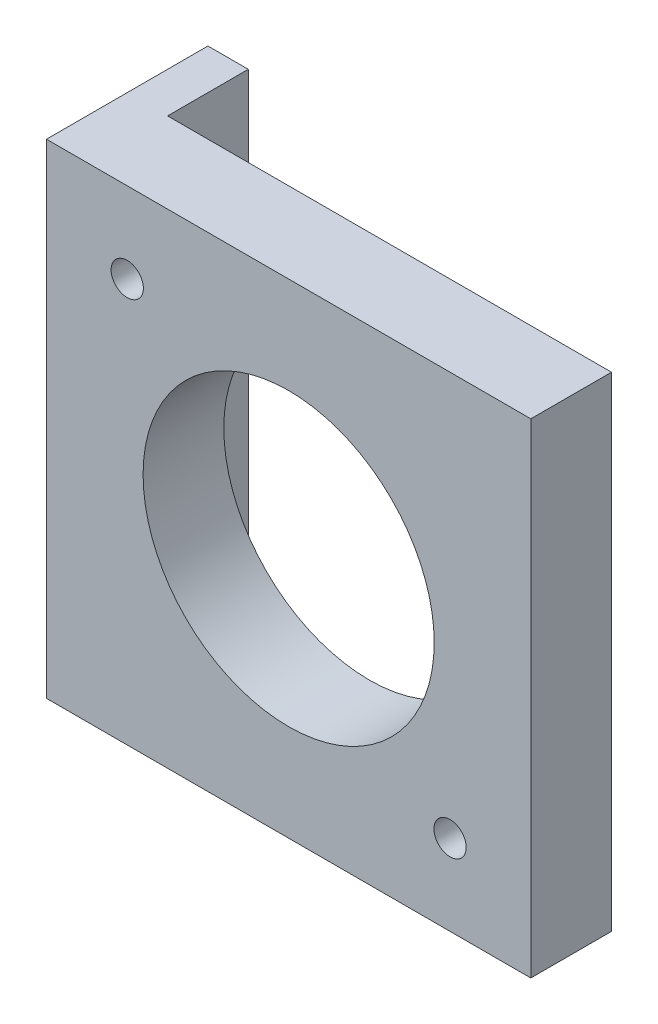
ISO-10303-21;
HEADER;
FILE_DESCRIPTION(('STEP AP214'),'2;1');
FILE_NAME('part.step','',(''),(''),'','','');
FILE_SCHEMA(('AUTOMOTIVE_DESIGN { 1 0 10303 214 1 1 1 1 }'));
ENDSEC;
DATA;
#1=APPLICATION_CONTEXT('core data for automotive mechanical design processes');
#2=APPLICATION_PROTOCOL_DEFINITION('international standard','automotive_design',2000,#1);
#3=PRODUCT_CONTEXT('',#1,'mechanical');
#4=PRODUCT('Part','Part','',(#3));
#5=PRODUCT_RELATED_PRODUCT_CATEGORY('part','',(#4));
#6=PRODUCT_DEFINITION_FORMATION('','',#4);
#7=PRODUCT_DEFINITION_CONTEXT('part definition',#1,'design');
#8=PRODUCT_DEFINITION('design','',#6,#7);
#9=PRODUCT_DEFINITION_SHAPE('','',#8);
#10=(LENGTH_UNIT() NAMED_UNIT(*) SI_UNIT(.MILLI.,.METRE.));
#11=(NAMED_UNIT(*) PLANE_ANGLE_UNIT() SI_UNIT($,.RADIAN.));
#12=(NAMED_UNIT(*) SI_UNIT($,.STERADIAN.) SOLID_ANGLE_UNIT());
#13=UNCERTAINTY_MEASURE_WITH_UNIT(LENGTH_MEASURE(1.E-05),#10,'distance_accuracy_value','');
#14=(GEOMETRIC_REPRESENTATION_CONTEXT(3) GLOBAL_UNCERTAINTY_ASSIGNED_CONTEXT((#13)) GLOBAL_UNIT_ASSIGNED_CONTEXT((#10,
#11,#12)) REPRESENTATION_CONTEXT('',''));
#15=CARTESIAN_POINT('',(0.,0.,0.));
#16=DIRECTION('',(0.,0.,1.));
#17=DIRECTION('',(1.,0.,0.));
#18=AXIS2_PLACEMENT_3D('',#15,#16,#17);
#19=CARTESIAN_POINT('',(0.,60.,0.));
#20=DIRECTION('',(0.,0.,-1.));
#21=DIRECTION('',(-1.,0.,0.));
#22=AXIS2_PLACEMENT_3D('',#19,#20,#21);
#23=PLANE('',#22);
#24=CARTESIAN_POINT('',(50.,10.,0.));
#25=DIRECTION('',(0.,0.,-1.));
#26=DIRECTION('',(-1.,0.,0.));
#27=AXIS2_PLACEMENT_3D('',#24,#25,#26);
#28=CIRCLE('',#27,2.);
#29=CARTESIAN_POINT('',(52.,10.,0.));
#30=VERTEX_POINT('',#29);
#31=EDGE_CURVE('E325',#30,#30,#28,.T.);
#32=ORIENTED_EDGE('',*,*,#31,.F.);
#33=EDGE_LOOP('',(#32));
#34=FACE_BOUND('',#33,.T.);
#35=CARTESIAN_POINT('',(9.99999999999999,50.,0.));
#36=DIRECTION('',(0.,0.,-1.));
#37=DIRECTION('',(-1.,0.,0.));
#38=AXIS2_PLACEMENT_3D('',#35,#36,#37);
#39=CIRCLE('',#38,2.);
#40=CARTESIAN_POINT('',(12.,50.,0.));
#41=VERTEX_POINT('',#40);
#42=EDGE_CURVE('E334',#41,#41,#39,.T.);
#43=ORIENTED_EDGE('',*,*,#42,.F.);
#44=EDGE_LOOP('',(#43));
#45=FACE_BOUND('',#44,.T.);
#46=CARTESIAN_POINT('',(9.99999999999998,10.,0.));
#47=DIRECTION('',(0.,0.,-1.));
#48=DIRECTION('',(-1.,0.,0.));
#49=AXIS2_PLACEMENT_3D('',#46,#47,#48);
#50=CIRCLE('',#49,2.5);
#51=CARTESIAN_POINT('',(7.49999999999998,10.,0.));
#52=VERTEX_POINT('',#51);
#53=EDGE_CURVE('E343',#52,#52,#50,.F.);
#54=ORIENTED_EDGE('',*,*,#53,.T.);
#55=EDGE_LOOP('',(#54));
#56=FACE_BOUND('',#55,.T.);
#57=DIRECTION('',(0.,-1.,0.));
#58=VECTOR('',#57,1.);
#59=CARTESIAN_POINT('',(5.,60.,0.));
#60=LINE('',#59,#58);
#61=CARTESIAN_POINT('',(4.99999999999999,60.,0.));
#62=VERTEX_POINT('',#61);
#63=CARTESIAN_POINT('',(4.99999999999999,0.,0.));
#64=VERTEX_POINT('',#63);
#65=EDGE_CURVE('E51',#62,#64,#60,.T.);
#66=ORIENTED_EDGE('',*,*,#65,.F.);
#67=DIRECTION('',(-1.,0.,0.));
#68=VECTOR('',#67,1.);
#69=CARTESIAN_POINT('',(0.,60.,0.));
#70=LINE('',#69,#68);
#71=CARTESIAN_POINT('',(60.,60.,0.));
#72=VERTEX_POINT('',#71);
#73=EDGE_CURVE('E144',#72,#62,#70,.T.);
#74=ORIENTED_EDGE('',*,*,#73,.F.);
#75=DIRECTION('',(0.,1.,0.));
#76=VECTOR('',#75,1.);
#77=CARTESIAN_POINT('',(60.,0.,0.));
#78=LINE('',#77,#76);
#79=CARTESIAN_POINT('',(60.,0.,0.));
#80=VERTEX_POINT('',#79);
#81=EDGE_CURVE('E76',#80,#72,#78,.T.);
#82=ORIENTED_EDGE('',*,*,#81,.F.);
#83=DIRECTION('',(1.,0.,0.));
#84=VECTOR('',#83,1.);
#85=CARTESIAN_POINT('',(0.,0.,0.));
#86=LINE('',#85,#84);
#87=EDGE_CURVE('E128',#64,#80,#86,.T.);
#88=ORIENTED_EDGE('',*,*,#87,.F.);
#89=EDGE_LOOP('',(#66,#74,#82,#88));
#90=FACE_BOUND('',#89,.T.);
#91=CARTESIAN_POINT('',(30.,30.,0.));
#92=DIRECTION('',(0.,0.,-1.));
#93=DIRECTION('',(-1.,0.,0.));
#94=AXIS2_PLACEMENT_3D('',#91,#92,#93);
#95=CIRCLE('',#94,18.034);
#96=CARTESIAN_POINT('',(11.966,30.,0.));
#97=VERTEX_POINT('',#96);
#98=EDGE_CURVE('E119',#97,#97,#95,.T.);
#99=ORIENTED_EDGE('',*,*,#98,.F.);
#100=EDGE_LOOP('',(#99));
#101=FACE_BOUND('',#100,.T.);
#102=CARTESIAN_POINT('',(50.,50.,0.));
#103=DIRECTION('',(0.,0.,-1.));
#104=DIRECTION('',(-1.,0.,0.));
#105=AXIS2_PLACEMENT_3D('',#102,#103,#104);
#106=CIRCLE('',#105,2.5);
#107=CARTESIAN_POINT('',(50.2685226002793,52.4855372886238,0.));
#108=VERTEX_POINT('',#107);
#109=EDGE_CURVE('E38',#108,#108,#106,.F.);
#110=ORIENTED_EDGE('',*,*,#109,.T.);
#111=EDGE_LOOP('',(#110));
#112=FACE_BOUND('',#111,.T.);
#113=ADVANCED_FACE('F34',(#34,#45,#56,#90,#101,#112),#23,.T.);
#114=CARTESIAN_POINT('',(0.,0.,10.));
#115=DIRECTION('',(1.,0.,0.));
#116=DIRECTION('',(0.,1.,0.));
#117=AXIS2_PLACEMENT_3D('',#114,#115,#116);
#118=PLANE('',#117);
#119=CARTESIAN_POINT('',(0.,10.,-6.));
#120=DIRECTION('',(-1.,0.,0.));
#121=DIRECTION('',(0.,0.,1.));
#122=AXIS2_PLACEMENT_3D('',#119,#120,#121);
#123=CIRCLE('',#122,2.);
#124=CARTESIAN_POINT('',(0.,10.,-4.));
#125=VERTEX_POINT('',#124);
#126=EDGE_CURVE('E344',#125,#125,#123,.T.);
#127=ORIENTED_EDGE('',*,*,#126,.F.);
#128=EDGE_LOOP('',(#127));
#129=FACE_BOUND('',#128,.T.);
#130=CARTESIAN_POINT('',(0.,50.,-6.));
#131=DIRECTION('',(-1.,0.,0.));
#132=DIRECTION('',(0.,0.,1.));
#133=AXIS2_PLACEMENT_3D('',#130,#131,#132);
#134=CIRCLE('',#133,2.);
#135=CARTESIAN_POINT('',(0.,50.,-4.));
#136=VERTEX_POINT('',#135);
#137=EDGE_CURVE('E348',#136,#136,#134,.T.);
#138=ORIENTED_EDGE('',*,*,#137,.F.);
#139=EDGE_LOOP('',(#138));
#140=FACE_BOUND('',#139,.T.);
#141=DIRECTION('',(0.,0.,-1.));
#142=VECTOR('',#141,1.);
#143=CARTESIAN_POINT('',(0.,60.,10.));
#144=LINE('',#143,#142);
#145=CARTESIAN_POINT('',(0.,60.,10.));
#146=VERTEX_POINT('',#145);
#147=CARTESIAN_POINT('',(0.,60.,-10.));
#148=VERTEX_POINT('',#147);
#149=EDGE_CURVE('E148',#146,#148,#144,.T.);
#150=ORIENTED_EDGE('',*,*,#149,.T.);
#151=DIRECTION('',(0.,1.,0.));
#152=VECTOR('',#151,1.);
#153=CARTESIAN_POINT('',(0.,60.,-10.));
#154=LINE('',#153,#152);
#155=CARTESIAN_POINT('',(0.,0.,-10.));
#156=VERTEX_POINT('',#155);
#157=EDGE_CURVE('E107',#156,#148,#154,.T.);
#158=ORIENTED_EDGE('',*,*,#157,.F.);
#159=DIRECTION('',(0.,0.,-1.));
#160=VECTOR('',#159,1.);
#161=CARTESIAN_POINT('',(0.,0.,10.));
#162=LINE('',#161,#160);
#163=CARTESIAN_POINT('',(0.,0.,10.));
#164=VERTEX_POINT('',#163);
#165=EDGE_CURVE('E11',#164,#156,#162,.T.);
#166=ORIENTED_EDGE('',*,*,#165,.F.);
#167=DIRECTION('',(0.,-1.,0.));
#168=VECTOR('',#167,1.);
#169=CARTESIAN_POINT('',(0.,0.,10.));
#170=LINE('',#169,#168);
#171=EDGE_CURVE('E142',#146,#164,#170,.T.);
#172=ORIENTED_EDGE('',*,*,#171,.F.);
#173=EDGE_LOOP('',(#150,#158,#166,#172));
#174=FACE_BOUND('',#173,.T.);
#175=ADVANCED_FACE('F36',(#129,#140,#174),#118,.F.);
#176=CARTESIAN_POINT('',(0.,0.,10.));
#177=DIRECTION('',(0.,1.,0.));
#178=DIRECTION('',(0.,0.,1.));
#179=AXIS2_PLACEMENT_3D('',#176,#177,#178);
#180=PLANE('',#179);
#181=ORIENTED_EDGE('',*,*,#165,.T.);
#182=DIRECTION('',(-1.,0.,0.));
#183=VECTOR('',#182,1.);
#184=CARTESIAN_POINT('',(4.99999999999999,0.,-10.));
#185=LINE('',#184,#183);
#186=CARTESIAN_POINT('',(4.99999999999999,0.,-10.));
#187=VERTEX_POINT('',#186);
#188=EDGE_CURVE('E98',#187,#156,#185,.T.);
#189=ORIENTED_EDGE('',*,*,#188,.F.);
#190=DIRECTION('',(0.,0.,1.));
#191=VECTOR('',#190,1.);
#192=CARTESIAN_POINT('',(4.99999999999999,0.,-10.));
#193=LINE('',#192,#191);
#194=EDGE_CURVE('E102',#187,#64,#193,.T.);
#195=ORIENTED_EDGE('',*,*,#194,.T.);
#196=ORIENTED_EDGE('',*,*,#87,.T.);
#197=DIRECTION('',(0.,0.,-1.));
#198=VECTOR('',#197,1.);
#199=CARTESIAN_POINT('',(60.,0.,10.));
#200=LINE('',#199,#198);
#201=CARTESIAN_POINT('',(60.,0.,10.));
#202=VERTEX_POINT('',#201);
#203=EDGE_CURVE('E43',#202,#80,#200,.T.);
#204=ORIENTED_EDGE('',*,*,#203,.F.);
#205=DIRECTION('',(1.,0.,0.));
#206=VECTOR('',#205,1.);
#207=CARTESIAN_POINT('',(0.,0.,10.));
#208=LINE('',#207,#206);
#209=EDGE_CURVE('E83',#164,#202,#208,.T.);
#210=ORIENTED_EDGE('',*,*,#209,.F.);
#211=EDGE_LOOP('',(#181,#189,#195,#196,#204,#210));
#212=FACE_BOUND('',#211,.T.);
#213=ADVANCED_FACE('F100',(#212),#180,.F.);
#214=CARTESIAN_POINT('',(60.,0.,10.));
#215=DIRECTION('',(-1.,0.,0.));
#216=DIRECTION('',(0.,-1.,0.));
#217=AXIS2_PLACEMENT_3D('',#214,#215,#216);
#218=PLANE('',#217);
#219=ORIENTED_EDGE('',*,*,#81,.T.);
#220=DIRECTION('',(0.,0.,-1.));
#221=VECTOR('',#220,1.);
#222=CARTESIAN_POINT('',(60.,60.,10.));
#223=LINE('',#222,#221);
#224=CARTESIAN_POINT('',(60.,60.,10.));
#225=VERTEX_POINT('',#224);
#226=EDGE_CURVE('E156',#225,#72,#223,.T.);
#227=ORIENTED_EDGE('',*,*,#226,.F.);
#228=DIRECTION('',(0.,1.,0.));
#229=VECTOR('',#228,1.);
#230=CARTESIAN_POINT('',(60.,0.,10.));
#231=LINE('',#230,#229);
#232=EDGE_CURVE('E146',#202,#225,#231,.T.);
#233=ORIENTED_EDGE('',*,*,#232,.F.);
#234=ORIENTED_EDGE('',*,*,#203,.T.);
#235=EDGE_LOOP('',(#219,#227,#233,#234));
#236=FACE_BOUND('',#235,.T.);
#237=ADVANCED_FACE('F163',(#236),#218,.F.);
#238=CARTESIAN_POINT('',(0.,60.,10.));
#239=DIRECTION('',(0.,-1.,0.));
#240=DIRECTION('',(0.,0.,-1.));
#241=AXIS2_PLACEMENT_3D('',#238,#239,#240);
#242=PLANE('',#241);
#243=ORIENTED_EDGE('',*,*,#73,.T.);
#244=DIRECTION('',(0.,0.,1.));
#245=VECTOR('',#244,1.);
#246=CARTESIAN_POINT('',(5.,60.,-10.));
#247=LINE('',#246,#245);
#248=CARTESIAN_POINT('',(5.,60.,-10.));
#249=VERTEX_POINT('',#248);
#250=EDGE_CURVE('E120',#249,#62,#247,.T.);
#251=ORIENTED_EDGE('',*,*,#250,.F.);
#252=DIRECTION('',(1.,0.,0.));
#253=VECTOR('',#252,1.);
#254=CARTESIAN_POINT('',(5.,60.,-10.));
#255=LINE('',#254,#253);
#256=EDGE_CURVE('E113',#148,#249,#255,.T.);
#257=ORIENTED_EDGE('',*,*,#256,.F.);
#258=ORIENTED_EDGE('',*,*,#149,.F.);
#259=DIRECTION('',(-1.,0.,0.));
#260=VECTOR('',#259,1.);
#261=CARTESIAN_POINT('',(0.,60.,10.));
#262=LINE('',#261,#260);
#263=EDGE_CURVE('E60',#225,#146,#262,.T.);
#264=ORIENTED_EDGE('',*,*,#263,.F.);
#265=ORIENTED_EDGE('',*,*,#226,.T.);
#266=EDGE_LOOP('',(#243,#251,#257,#258,#264,#265));
#267=FACE_BOUND('',#266,.T.);
#268=ADVANCED_FACE('F160',(#267),#242,.F.);
#269=CARTESIAN_POINT('',(0.,60.,10.));
#270=DIRECTION('',(0.,0.,-1.));
#271=DIRECTION('',(-1.,0.,0.));
#272=AXIS2_PLACEMENT_3D('',#269,#270,#271);
#273=PLANE('',#272);
#274=CARTESIAN_POINT('',(50.,10.,10.));
#275=DIRECTION('',(0.,0.,1.));
#276=DIRECTION('',(1.,0.,0.));
#277=AXIS2_PLACEMENT_3D('',#274,#275,#276);
#278=CIRCLE('',#277,2.);
#279=CARTESIAN_POINT('',(52.,10.,10.));
#280=VERTEX_POINT('',#279);
#281=EDGE_CURVE('E327',#280,#280,#278,.T.);
#282=ORIENTED_EDGE('',*,*,#281,.F.);
#283=EDGE_LOOP('',(#282));
#284=FACE_BOUND('',#283,.T.);
#285=CARTESIAN_POINT('',(9.99999999999999,50.,10.));
#286=DIRECTION('',(0.,0.,1.));
#287=DIRECTION('',(1.,0.,0.));
#288=AXIS2_PLACEMENT_3D('',#285,#286,#287);
#289=CIRCLE('',#288,2.);
#290=CARTESIAN_POINT('',(12.,50.,10.));
#291=VERTEX_POINT('',#290);
#292=EDGE_CURVE('E329',#291,#291,#289,.T.);
#293=ORIENTED_EDGE('',*,*,#292,.F.);
#294=EDGE_LOOP('',(#293));
#295=FACE_BOUND('',#294,.T.);
#296=CARTESIAN_POINT('',(30.,30.,10.));
#297=DIRECTION('',(0.,0.,-1.));
#298=DIRECTION('',(-1.,0.,0.));
#299=AXIS2_PLACEMENT_3D('',#296,#297,#298);
#300=CIRCLE('',#299,18.034);
#301=CARTESIAN_POINT('',(11.966,30.,10.));
#302=VERTEX_POINT('',#301);
#303=EDGE_CURVE('E123',#302,#302,#300,.T.);
#304=ORIENTED_EDGE('',*,*,#303,.T.);
#305=EDGE_LOOP('',(#304));
#306=FACE_BOUND('',#305,.T.);
#307=ORIENTED_EDGE('',*,*,#171,.T.);
#308=ORIENTED_EDGE('',*,*,#209,.T.);
#309=ORIENTED_EDGE('',*,*,#232,.T.);
#310=ORIENTED_EDGE('',*,*,#263,.T.);
#311=EDGE_LOOP('',(#307,#308,#309,#310));
#312=FACE_BOUND('',#311,.T.);
#313=ADVANCED_FACE('F164',(#284,#295,#306,#312),#273,.F.);
#314=CARTESIAN_POINT('',(30.,30.,10.));
#315=DIRECTION('',(0.,0.,-1.));
#316=DIRECTION('',(-1.,0.,0.));
#317=AXIS2_PLACEMENT_3D('',#314,#315,#316);
#318=CYLINDRICAL_SURFACE('',#317,18.034);
#319=ORIENTED_EDGE('',*,*,#303,.F.);
#320=EDGE_LOOP('',(#319));
#321=FACE_BOUND('',#320,.T.);
#322=ORIENTED_EDGE('',*,*,#98,.T.);
#323=EDGE_LOOP('',(#322));
#324=FACE_BOUND('',#323,.T.);
#325=ADVANCED_FACE('F166',(#321,#324),#318,.F.);
#326=CARTESIAN_POINT('',(5.,60.,-10.));
#327=DIRECTION('',(-1.,0.,0.));
#328=DIRECTION('',(0.,-1.,0.));
#329=AXIS2_PLACEMENT_3D('',#326,#327,#328);
#330=PLANE('',#329);
#331=CARTESIAN_POINT('',(4.99999999999999,10.,-6.));
#332=DIRECTION('',(-1.,0.,0.));
#333=DIRECTION('',(0.,-1.,0.));
#334=AXIS2_PLACEMENT_3D('',#331,#332,#333);
#335=CIRCLE('',#334,2.);
#336=CARTESIAN_POINT('',(4.99999999999999,10.,-4.));
#337=VERTEX_POINT('',#336);
#338=EDGE_CURVE('E347',#337,#337,#335,.T.);
#339=ORIENTED_EDGE('',*,*,#338,.T.);
#340=EDGE_LOOP('',(#339));
#341=FACE_BOUND('',#340,.T.);
#342=CARTESIAN_POINT('',(5.,50.,-6.));
#343=DIRECTION('',(-1.,0.,0.));
#344=DIRECTION('',(0.,-1.,0.));
#345=AXIS2_PLACEMENT_3D('',#342,#343,#344);
#346=CIRCLE('',#345,2.);
#347=CARTESIAN_POINT('',(5.,50.,-4.));
#348=VERTEX_POINT('',#347);
#349=EDGE_CURVE('E134',#348,#348,#346,.T.);
#350=ORIENTED_EDGE('',*,*,#349,.T.);
#351=EDGE_LOOP('',(#350));
#352=FACE_BOUND('',#351,.T.);
#353=ORIENTED_EDGE('',*,*,#65,.T.);
#354=ORIENTED_EDGE('',*,*,#194,.F.);
#355=DIRECTION('',(0.,-1.,0.));
#356=VECTOR('',#355,1.);
#357=CARTESIAN_POINT('',(5.,60.,-10.));
#358=LINE('',#357,#356);
#359=EDGE_CURVE('E108',#249,#187,#358,.T.);
#360=ORIENTED_EDGE('',*,*,#359,.F.);
#361=ORIENTED_EDGE('',*,*,#250,.T.);
#362=EDGE_LOOP('',(#353,#354,#360,#361));
#363=FACE_BOUND('',#362,.T.);
#364=ADVANCED_FACE('F118',(#341,#352,#363),#330,.F.);
#365=CARTESIAN_POINT('',(4.99999999999999,0.,-10.));
#366=DIRECTION('',(0.,0.,-1.));
#367=DIRECTION('',(-1.,0.,0.));
#368=AXIS2_PLACEMENT_3D('',#365,#366,#367);
#369=PLANE('',#368);
#370=ORIENTED_EDGE('',*,*,#359,.T.);
#371=ORIENTED_EDGE('',*,*,#188,.T.);
#372=ORIENTED_EDGE('',*,*,#157,.T.);
#373=ORIENTED_EDGE('',*,*,#256,.T.);
#374=EDGE_LOOP('',(#370,#371,#372,#373));
#375=FACE_BOUND('',#374,.T.);
#376=ADVANCED_FACE('F111',(#375),#369,.T.);
#377=CARTESIAN_POINT('',(60.000025,50.,-6.));
#378=DIRECTION('',(-1.,0.,0.));
#379=DIRECTION('',(0.,0.,1.));
#380=AXIS2_PLACEMENT_3D('',#377,#378,#379);
#381=CYLINDRICAL_SURFACE('',#380,2.);
#382=CARTESIAN_POINT('',(0.,50.,-4.));
#383=CARTESIAN_POINT('',(0.0520833333333322,50.,-4.));
#384=CARTESIAN_POINT('',(0.104166666666664,50.,-4.));
#385=CARTESIAN_POINT('',(0.208333333333331,50.,-4.));
#386=CARTESIAN_POINT('',(0.260416666666666,50.,-4.));
#387=CARTESIAN_POINT('',(0.364583333333335,50.,-4.));
#388=CARTESIAN_POINT('',(0.416666666666669,50.,-4.));
#389=CARTESIAN_POINT('',(0.520833333333336,50.,-4.));
#390=CARTESIAN_POINT('',(0.572916666666668,50.,-4.));
#391=CARTESIAN_POINT('',(0.677083333333333,50.,-4.));
#392=CARTESIAN_POINT('',(0.729166666666665,50.,-4.));
#393=CARTESIAN_POINT('',(0.833333333333332,50.,-4.));
#394=CARTESIAN_POINT('',(0.885416666666666,50.,-4.));
#395=CARTESIAN_POINT('',(0.989583333333335,50.,-4.));
#396=CARTESIAN_POINT('',(1.04166666666667,50.,-4.));
#397=CARTESIAN_POINT('',(1.14583333333334,50.,-4.));
#398=CARTESIAN_POINT('',(1.19791666666667,50.,-4.));
#399=CARTESIAN_POINT('',(1.30208333333333,50.,-4.));
#400=CARTESIAN_POINT('',(1.35416666666667,50.,-4.));
#401=CARTESIAN_POINT('',(1.45833333333333,50.,-4.));
#402=CARTESIAN_POINT('',(1.51041666666667,50.,-4.));
#403=CARTESIAN_POINT('',(1.61458333333334,50.,-4.));
#404=CARTESIAN_POINT('',(1.66666666666667,50.,-4.));
#405=CARTESIAN_POINT('',(1.77083333333334,50.,-4.));
#406=CARTESIAN_POINT('',(1.82291666666667,50.,-4.));
#407=CARTESIAN_POINT('',(1.92708333333333,50.,-4.));
#408=CARTESIAN_POINT('',(1.97916666666667,50.,-4.));
#409=CARTESIAN_POINT('',(2.08333333333333,50.,-4.));
#410=CARTESIAN_POINT('',(2.13541666666667,50.,-4.));
#411=CARTESIAN_POINT('',(2.23958333333334,50.,-4.));
#412=CARTESIAN_POINT('',(2.29166666666667,50.,-4.));
#413=CARTESIAN_POINT('',(2.39583333333334,50.,-4.));
#414=CARTESIAN_POINT('',(2.44791666666667,50.,-4.));
#415=CARTESIAN_POINT('',(2.55208333333333,50.,-4.));
#416=CARTESIAN_POINT('',(2.60416666666667,50.,-4.));
#417=CARTESIAN_POINT('',(2.70833333333333,50.,-4.));
#418=CARTESIAN_POINT('',(2.76041666666667,50.,-4.));
#419=CARTESIAN_POINT('',(2.86458333333334,50.,-4.));
#420=CARTESIAN_POINT('',(2.91666666666667,50.,-4.));
#421=CARTESIAN_POINT('',(3.02083333333334,50.,-4.));
#422=CARTESIAN_POINT('',(3.07291666666667,50.,-4.));
#423=CARTESIAN_POINT('',(3.17708333333334,50.,-4.));
#424=CARTESIAN_POINT('',(3.22916666666667,50.,-4.));
#425=CARTESIAN_POINT('',(3.33333333333333,50.,-4.));
#426=CARTESIAN_POINT('',(3.38541666666667,50.,-4.));
#427=CARTESIAN_POINT('',(3.48958333333334,50.,-4.));
#428=CARTESIAN_POINT('',(3.54166666666667,50.,-4.));
#429=CARTESIAN_POINT('',(3.64583333333334,50.,-4.));
#430=CARTESIAN_POINT('',(3.69791666666667,50.,-4.));
#431=CARTESIAN_POINT('',(3.80208333333334,50.,-4.));
#432=CARTESIAN_POINT('',(3.85416666666667,50.,-4.));
#433=CARTESIAN_POINT('',(3.95833333333333,50.,-4.));
#434=CARTESIAN_POINT('',(4.01041666666667,50.,-4.));
#435=CARTESIAN_POINT('',(4.11458333333334,50.,-4.));
#436=CARTESIAN_POINT('',(4.16666666666667,50.,-4.));
#437=CARTESIAN_POINT('',(4.27083333333334,50.,-4.));
#438=CARTESIAN_POINT('',(4.32291666666667,50.,-4.));
#439=CARTESIAN_POINT('',(4.42708333333334,50.,-4.));
#440=CARTESIAN_POINT('',(4.47916666666667,50.,-4.));
#441=CARTESIAN_POINT('',(4.58333333333333,50.,-4.));
#442=CARTESIAN_POINT('',(4.63541666666667,50.,-4.));
#443=CARTESIAN_POINT('',(4.73958333333334,50.,-4.));
#444=CARTESIAN_POINT('',(4.79166666666667,50.,-4.));
#445=CARTESIAN_POINT('',(4.89583333333334,50.,-4.));
#446=CARTESIAN_POINT('',(4.94791666666667,50.,-4.));
#447=CARTESIAN_POINT('',(5.,50.,-4.));
#448=B_SPLINE_CURVE_WITH_KNOTS('',3,(#382,#383,#384,#385,#386,#387,#388,#389,#390,#391,#392,
#393,#394,#395,#396,#397,#398,#399,#400,#401,#402,#403,#404,#405,#406,#407,#408,#409,#410,#411,
#412,#413,#414,#415,#416,#417,#418,#419,#420,#421,#422,#423,#424,#425,#426,#427,#428,#429,#430,
#431,#432,#433,#434,#435,#436,#437,#438,#439,#440,#441,#442,#443,#444,#445,#446,#447),
.UNSPECIFIED.,.F.,.F.,(4,2,2,2,2,2,2,2,2,2,2,2,2,2,2,2,2,2,2,2,2,2,2,2,2,2,2,2,2,2,2,2,4),(0.,
0.156249999999997,0.3125,0.468750000000004,0.625000000000001,0.781249999999997,
0.937500000000001,1.09375,1.25,1.40625,1.5625,1.71875,1.875,2.03125,2.1875,2.34375000000001,2.5,
2.65625,2.8125,2.96875000000001,3.125,3.28125,3.4375,3.59375000000001,3.75,3.90625,4.0625,
4.21875000000001,4.375,4.53125,4.6875,4.84375000000001,5.),.UNSPECIFIED.);
#449=EDGE_CURVE('BSEAM214',#136,#348,#448,.T.);
#450=ORIENTED_EDGE('',*,*,#137,.T.);
#451=ORIENTED_EDGE('',*,*,#349,.F.);
#452=ORIENTED_EDGE('',*,*,#449,.T.);
#453=ORIENTED_EDGE('',*,*,#449,.F.);
#454=EDGE_LOOP('',(#450,#452,#451,#453));
#455=FACE_BOUND('',#454,.T.);
#456=ADVANCED_FACE('F214',(#455),#381,.F.);
#457=CARTESIAN_POINT('',(60.000025,10.,-6.));
#458=DIRECTION('',(-1.,0.,0.));
#459=DIRECTION('',(0.,0.,1.));
#460=AXIS2_PLACEMENT_3D('',#457,#458,#459);
#461=CYLINDRICAL_SURFACE('',#460,2.);
#462=CARTESIAN_POINT('',(0.,10.,-4.));
#463=CARTESIAN_POINT('',(0.0520833333333322,10.,-4.));
#464=CARTESIAN_POINT('',(0.104166666666664,10.,-4.));
#465=CARTESIAN_POINT('',(0.208333333333331,10.,-4.));
#466=CARTESIAN_POINT('',(0.260416666666666,10.,-4.));
#467=CARTESIAN_POINT('',(0.364583333333332,10.,-4.));
#468=CARTESIAN_POINT('',(0.416666666666665,10.,-4.));
#469=CARTESIAN_POINT('',(0.520833333333331,10.,-4.));
#470=CARTESIAN_POINT('',(0.572916666666666,10.,-4.));
#471=CARTESIAN_POINT('',(0.677083333333333,10.,-4.));
#472=CARTESIAN_POINT('',(0.729166666666665,10.,-4.));
#473=CARTESIAN_POINT('',(0.833333333333332,10.,-4.));
#474=CARTESIAN_POINT('',(0.885416666666666,10.,-4.));
#475=CARTESIAN_POINT('',(0.989583333333333,10.,-4.));
#476=CARTESIAN_POINT('',(1.04166666666667,10.,-4.));
#477=CARTESIAN_POINT('',(1.14583333333333,10.,-4.));
#478=CARTESIAN_POINT('',(1.19791666666667,10.,-4.));
#479=CARTESIAN_POINT('',(1.30208333333333,10.,-4.));
#480=CARTESIAN_POINT('',(1.35416666666667,10.,-4.));
#481=CARTESIAN_POINT('',(1.45833333333333,10.,-4.));
#482=CARTESIAN_POINT('',(1.51041666666666,10.,-4.));
#483=CARTESIAN_POINT('',(1.61458333333333,10.,-4.));
#484=CARTESIAN_POINT('',(1.66666666666666,10.,-4.));
#485=CARTESIAN_POINT('',(1.77083333333333,10.,-4.));
#486=CARTESIAN_POINT('',(1.82291666666666,10.,-4.));
#487=CARTESIAN_POINT('',(1.92708333333333,10.,-4.));
#488=CARTESIAN_POINT('',(1.97916666666666,10.,-4.));
#489=CARTESIAN_POINT('',(2.08333333333333,10.,-4.));
#490=CARTESIAN_POINT('',(2.13541666666666,10.,-4.));
#491=CARTESIAN_POINT('',(2.23958333333333,10.,-4.));
#492=CARTESIAN_POINT('',(2.29166666666666,10.,-4.));
#493=CARTESIAN_POINT('',(2.39583333333333,10.,-4.));
#494=CARTESIAN_POINT('',(2.44791666666666,10.,-4.));
#495=CARTESIAN_POINT('',(2.55208333333333,10.,-4.));
#496=CARTESIAN_POINT('',(2.60416666666666,10.,-4.));
#497=CARTESIAN_POINT('',(2.70833333333333,10.,-4.));
#498=CARTESIAN_POINT('',(2.76041666666666,10.,-4.));
#499=CARTESIAN_POINT('',(2.86458333333333,10.,-4.));
#500=CARTESIAN_POINT('',(2.91666666666666,10.,-4.));
#501=CARTESIAN_POINT('',(3.02083333333333,10.,-4.));
#502=CARTESIAN_POINT('',(3.07291666666666,10.,-4.));
#503=CARTESIAN_POINT('',(3.17708333333333,10.,-4.));
#504=CARTESIAN_POINT('',(3.22916666666666,10.,-4.));
#505=CARTESIAN_POINT('',(3.33333333333333,10.,-4.));
#506=CARTESIAN_POINT('',(3.38541666666666,10.,-4.));
#507=CARTESIAN_POINT('',(3.48958333333333,10.,-4.));
#508=CARTESIAN_POINT('',(3.54166666666666,10.,-4.));
#509=CARTESIAN_POINT('',(3.64583333333333,10.,-4.));
#510=CARTESIAN_POINT('',(3.69791666666666,10.,-4.));
#511=CARTESIAN_POINT('',(3.80208333333332,10.,-4.));
#512=CARTESIAN_POINT('',(3.85416666666666,10.,-4.));
#513=CARTESIAN_POINT('',(3.95833333333333,10.,-4.));
#514=CARTESIAN_POINT('',(4.01041666666666,10.,-4.));
#515=CARTESIAN_POINT('',(4.11458333333332,10.,-4.));
#516=CARTESIAN_POINT('',(4.16666666666666,10.,-4.));
#517=CARTESIAN_POINT('',(4.27083333333333,10.,-4.));
#518=CARTESIAN_POINT('',(4.32291666666666,10.,-4.));
#519=CARTESIAN_POINT('',(4.42708333333332,10.,-4.));
#520=CARTESIAN_POINT('',(4.47916666666666,10.,-4.));
#521=CARTESIAN_POINT('',(4.58333333333333,10.,-4.));
#522=CARTESIAN_POINT('',(4.63541666666666,10.,-4.));
#523=CARTESIAN_POINT('',(4.73958333333333,10.,-4.));
#524=CARTESIAN_POINT('',(4.79166666666666,10.,-4.));
#525=CARTESIAN_POINT('',(4.89583333333333,10.,-4.));
#526=CARTESIAN_POINT('',(4.94791666666666,10.,-4.));
#527=CARTESIAN_POINT('',(4.99999999999999,10.,-4.));
#528=B_SPLINE_CURVE_WITH_KNOTS('',3,(#462,#463,#464,#465,#466,#467,#468,#469,#470,#471,#472,
#473,#474,#475,#476,#477,#478,#479,#480,#481,#482,#483,#484,#485,#486,#487,#488,#489,#490,#491,
#492,#493,#494,#495,#496,#497,#498,#499,#500,#501,#502,#503,#504,#505,#506,#507,#508,#509,#510,
#511,#512,#513,#514,#515,#516,#517,#518,#519,#520,#521,#522,#523,#524,#525,#526,#527),
.UNSPECIFIED.,.F.,.F.,(4,2,2,2,2,2,2,2,2,2,2,2,2,2,2,2,2,2,2,2,2,2,2,2,2,2,2,2,2,2,2,2,4),(0.,
0.156249999999997,0.3125,0.468749999999997,0.625000000000001,0.781249999999997,
0.937500000000001,1.09375,1.25,1.40625,1.56249999999999,1.71875,1.87499999999999,2.03125,2.1875,
2.34375,2.5,2.65624999999999,2.8125,2.96874999999999,3.125,3.28124999999999,3.4375,
3.59374999999999,3.74999999999999,3.90624999999999,4.06249999999999,4.21874999999999,
4.37499999999999,4.53124999999999,4.68749999999999,4.84374999999999,4.99999999999999),.UNSPECIFIED.);
#529=EDGE_CURVE('BSEAM239',#125,#337,#528,.T.);
#530=ORIENTED_EDGE('',*,*,#126,.T.);
#531=ORIENTED_EDGE('',*,*,#338,.F.);
#532=ORIENTED_EDGE('',*,*,#529,.T.);
#533=ORIENTED_EDGE('',*,*,#529,.F.);
#534=EDGE_LOOP('',(#530,#532,#531,#533));
#535=FACE_BOUND('',#534,.T.);
#536=ADVANCED_FACE('F239',(#535),#461,.F.);
#537=CARTESIAN_POINT('',(9.99999999999998,10.,4.99999999999999));
#538=DIRECTION('',(0.,0.,-1.));
#539=DIRECTION('',(-0.99716147316356,-0.0752927382838369,0.));
#540=AXIS2_PLACEMENT_3D('',#537,#538,#539);
#541=CYLINDRICAL_SURFACE('',#540,2.5);
#542=ORIENTED_EDGE('',*,*,#53,.F.);
#543=EDGE_LOOP('',(#542));
#544=FACE_BOUND('',#543,.T.);
#545=CARTESIAN_POINT('',(9.99999999999998,10.,4.99999999999999));
#546=DIRECTION('',(0.,0.,1.));
#547=DIRECTION('',(0.99716147316356,0.0752927382838369,0.));
#548=AXIS2_PLACEMENT_3D('',#545,#546,#547);
#549=CIRCLE('',#548,2.5);
#550=CARTESIAN_POINT('',(12.4929036829089,10.1882318457096,4.99999999999999));
#551=VERTEX_POINT('',#550);
#552=EDGE_CURVE('E340',#551,#551,#549,.T.);
#553=ORIENTED_EDGE('',*,*,#552,.T.);
#554=EDGE_LOOP('',(#553));
#555=FACE_BOUND('',#554,.T.);
#556=ADVANCED_FACE('F249',(#544,#555),#541,.F.);
#557=CARTESIAN_POINT('',(9.99999999999998,10.,4.99999999999999));
#558=DIRECTION('',(0.,0.,1.));
#559=DIRECTION('',(0.99716147316356,0.0752927382838369,0.));
#560=AXIS2_PLACEMENT_3D('',#557,#558,#559);
#561=PLANE('',#560);
#562=ORIENTED_EDGE('',*,*,#552,.F.);
#563=EDGE_LOOP('',(#562));
#564=FACE_BOUND('',#563,.T.);
#565=ADVANCED_FACE('F260',(#564),#561,.F.);
#566=CARTESIAN_POINT('',(50.,50.,4.99999999999999));
#567=DIRECTION('',(0.,0.,-1.));
#568=DIRECTION('',(0.107409040111746,0.994214915449508,0.));
#569=AXIS2_PLACEMENT_3D('',#566,#567,#568);
#570=CYLINDRICAL_SURFACE('',#569,2.5);
#571=CARTESIAN_POINT('',(50.,50.,4.99999999999999));
#572=DIRECTION('',(0.,0.,1.));
#573=DIRECTION('',(-0.107409040111746,-0.994214915449508,0.));
#574=AXIS2_PLACEMENT_3D('',#571,#572,#573);
#575=CIRCLE('',#574,2.5);
#576=CARTESIAN_POINT('',(50.2685226002793,52.4855372886238,4.99999999999999));
#577=VERTEX_POINT('',#576);
#578=EDGE_CURVE('E337',#577,#577,#575,.T.);
#579=CARTESIAN_POINT('',(50.2685226002793,52.4855372886238,0.));
#580=CARTESIAN_POINT('',(50.2685226002793,52.4855372886238,0.0520833333333341));
#581=CARTESIAN_POINT('',(50.2685226002793,52.4855372886238,0.104166666666668));
#582=CARTESIAN_POINT('',(50.2685226002793,52.4855372886238,0.208333333333334));
#583=CARTESIAN_POINT('',(50.2685226002793,52.4855372886238,0.260416666666667));
#584=CARTESIAN_POINT('',(50.2685226002793,52.4855372886238,0.364583333333333));
#585=CARTESIAN_POINT('',(50.2685226002793,52.4855372886238,0.416666666666666));
#586=CARTESIAN_POINT('',(50.2685226002793,52.4855372886238,0.520833333333333));
#587=CARTESIAN_POINT('',(50.2685226002793,52.4855372886238,0.572916666666666));
#588=CARTESIAN_POINT('',(50.2685226002793,52.4855372886238,0.677083333333333));
#589=CARTESIAN_POINT('',(50.2685226002793,52.4855372886238,0.729166666666667));
#590=CARTESIAN_POINT('',(50.2685226002793,52.4855372886238,0.833333333333333));
#591=CARTESIAN_POINT('',(50.2685226002793,52.4855372886238,0.885416666666666));
#592=CARTESIAN_POINT('',(50.2685226002793,52.4855372886238,0.989583333333332));
#593=CARTESIAN_POINT('',(50.2685226002793,52.4855372886238,1.04166666666667));
#594=CARTESIAN_POINT('',(50.2685226002793,52.4855372886238,1.14583333333333));
#595=CARTESIAN_POINT('',(50.2685226002793,52.4855372886238,1.19791666666666));
#596=CARTESIAN_POINT('',(50.2685226002793,52.4855372886238,1.30208333333333));
#597=CARTESIAN_POINT('',(50.2685226002793,52.4855372886238,1.35416666666666));
#598=CARTESIAN_POINT('',(50.2685226002793,52.4855372886238,1.45833333333333));
#599=CARTESIAN_POINT('',(50.2685226002793,52.4855372886238,1.51041666666666));
#600=CARTESIAN_POINT('',(50.2685226002793,52.4855372886238,1.61458333333333));
#601=CARTESIAN_POINT('',(50.2685226002793,52.4855372886238,1.66666666666666));
#602=CARTESIAN_POINT('',(50.2685226002793,52.4855372886238,1.77083333333333));
#603=CARTESIAN_POINT('',(50.2685226002793,52.4855372886238,1.82291666666666));
#604=CARTESIAN_POINT('',(50.2685226002793,52.4855372886238,1.92708333333333));
#605=CARTESIAN_POINT('',(50.2685226002793,52.4855372886238,1.97916666666666));
#606=CARTESIAN_POINT('',(50.2685226002793,52.4855372886238,2.08333333333333));
#607=CARTESIAN_POINT('',(50.2685226002793,52.4855372886238,2.13541666666666));
#608=CARTESIAN_POINT('',(50.2685226002793,52.4855372886238,2.23958333333333));
#609=CARTESIAN_POINT('',(50.2685226002793,52.4855372886238,2.29166666666666));
#610=CARTESIAN_POINT('',(50.2685226002793,52.4855372886238,2.39583333333333));
#611=CARTESIAN_POINT('',(50.2685226002793,52.4855372886238,2.44791666666666));
#612=CARTESIAN_POINT('',(50.2685226002793,52.4855372886238,2.55208333333333));
#613=CARTESIAN_POINT('',(50.2685226002793,52.4855372886238,2.60416666666666));
#614=CARTESIAN_POINT('',(50.2685226002793,52.4855372886238,2.70833333333333));
#615=CARTESIAN_POINT('',(50.2685226002793,52.4855372886238,2.76041666666666));
#616=CARTESIAN_POINT('',(50.2685226002793,52.4855372886238,2.86458333333333));
#617=CARTESIAN_POINT('',(50.2685226002793,52.4855372886238,2.91666666666666));
#618=CARTESIAN_POINT('',(50.2685226002793,52.4855372886238,3.02083333333333));
#619=CARTESIAN_POINT('',(50.2685226002793,52.4855372886238,3.07291666666666));
#620=CARTESIAN_POINT('',(50.2685226002793,52.4855372886238,3.17708333333333));
#621=CARTESIAN_POINT('',(50.2685226002793,52.4855372886238,3.22916666666666));
#622=CARTESIAN_POINT('',(50.2685226002793,52.4855372886238,3.33333333333333));
#623=CARTESIAN_POINT('',(50.2685226002793,52.4855372886238,3.38541666666666));
#624=CARTESIAN_POINT('',(50.2685226002793,52.4855372886238,3.48958333333333));
#625=CARTESIAN_POINT('',(50.2685226002793,52.4855372886238,3.54166666666666));
#626=CARTESIAN_POINT('',(50.2685226002793,52.4855372886238,3.64583333333333));
#627=CARTESIAN_POINT('',(50.2685226002793,52.4855372886238,3.69791666666666));
#628=CARTESIAN_POINT('',(50.2685226002793,52.4855372886238,3.80208333333333));
#629=CARTESIAN_POINT('',(50.2685226002793,52.4855372886238,3.85416666666666));
#630=CARTESIAN_POINT('',(50.2685226002793,52.4855372886238,3.95833333333333));
#631=CARTESIAN_POINT('',(50.2685226002793,52.4855372886238,4.01041666666666));
#632=CARTESIAN_POINT('',(50.2685226002793,52.4855372886238,4.11458333333333));
#633=CARTESIAN_POINT('',(50.2685226002793,52.4855372886238,4.16666666666666));
#634=CARTESIAN_POINT('',(50.2685226002793,52.4855372886238,4.27083333333333));
#635=CARTESIAN_POINT('',(50.2685226002793,52.4855372886238,4.32291666666666));
#636=CARTESIAN_POINT('',(50.2685226002793,52.4855372886238,4.42708333333333));
#637=CARTESIAN_POINT('',(50.2685226002793,52.4855372886238,4.47916666666666));
#638=CARTESIAN_POINT('',(50.2685226002793,52.4855372886238,4.58333333333333));
#639=CARTESIAN_POINT('',(50.2685226002793,52.4855372886238,4.63541666666666));
#640=CARTESIAN_POINT('',(50.2685226002793,52.4855372886238,4.73958333333332));
#641=CARTESIAN_POINT('',(50.2685226002793,52.4855372886238,4.79166666666666));
#642=CARTESIAN_POINT('',(50.2685226002793,52.4855372886238,4.89583333333332));
#643=CARTESIAN_POINT('',(50.2685226002793,52.4855372886238,4.94791666666666));
#644=CARTESIAN_POINT('',(50.2685226002793,52.4855372886238,4.99999999999999));
#645=B_SPLINE_CURVE_WITH_KNOTS('',3,(#579,#580,#581,#582,#583,#584,#585,#586,#587,#588,#589,
#590,#591,#592,#593,#594,#595,#596,#597,#598,#599,#600,#601,#602,#603,#604,#605,#606,#607,#608,
#609,#610,#611,#612,#613,#614,#615,#616,#617,#618,#619,#620,#621,#622,#623,#624,#625,#626,#627,
#628,#629,#630,#631,#632,#633,#634,#635,#636,#637,#638,#639,#640,#641,#642,#643,#644),
.UNSPECIFIED.,.F.,.F.,(4,2,2,2,2,2,2,2,2,2,2,2,2,2,2,2,2,2,2,2,2,2,2,2,2,2,2,2,2,2,2,2,4),(0.,
0.15625,0.312499999999999,0.468749999999999,0.624999999999999,0.781249999999999,
0.937499999999998,1.09375,1.25,1.40625,1.5625,1.71875,1.875,2.03125,2.1875,2.34375,
2.49999999999999,2.65624999999999,2.81249999999999,2.96874999999999,3.12499999999999,
3.28124999999999,3.43749999999999,3.59374999999999,3.74999999999999,3.90624999999999,
4.06249999999999,4.21874999999999,4.37499999999999,4.53124999999999,4.68749999999999,
4.84374999999999,4.99999999999999),.UNSPECIFIED.);
#646=EDGE_CURVE('BSEAM270',#108,#577,#645,.T.);
#647=ORIENTED_EDGE('',*,*,#109,.F.);
#648=ORIENTED_EDGE('',*,*,#578,.T.);
#649=ORIENTED_EDGE('',*,*,#646,.T.);
#650=ORIENTED_EDGE('',*,*,#646,.F.);
#651=EDGE_LOOP('',(#647,#649,#648,#650));
#652=FACE_BOUND('',#651,.T.);
#653=ADVANCED_FACE('F270',(#652),#570,.F.);
#654=CARTESIAN_POINT('',(50.,50.,4.99999999999999));
#655=DIRECTION('',(0.,0.,1.));
#656=DIRECTION('',(-0.107409040111746,-0.994214915449508,0.));
#657=AXIS2_PLACEMENT_3D('',#654,#655,#656);
#658=PLANE('',#657);
#659=ORIENTED_EDGE('',*,*,#578,.F.);
#660=EDGE_LOOP('',(#659));
#661=FACE_BOUND('',#660,.T.);
#662=ADVANCED_FACE('F280',(#661),#658,.F.);
#663=CARTESIAN_POINT('',(9.99999999999999,50.,-10.000025));
#664=DIRECTION('',(0.,0.,1.));
#665=DIRECTION('',(1.,0.,0.));
#666=AXIS2_PLACEMENT_3D('',#663,#664,#665);
#667=CYLINDRICAL_SURFACE('',#666,2.);
#668=CARTESIAN_POINT('',(12.,50.,0.));
#669=CARTESIAN_POINT('',(12.,50.,0.104166666666667));
#670=CARTESIAN_POINT('',(12.,50.,0.208333333333334));
#671=CARTESIAN_POINT('',(12.,50.,0.416666666666667));
#672=CARTESIAN_POINT('',(12.,50.,0.520833333333334));
#673=CARTESIAN_POINT('',(12.,50.,0.729166666666667));
#674=CARTESIAN_POINT('',(12.,50.,0.833333333333334));
#675=CARTESIAN_POINT('',(12.,50.,1.04166666666667));
#676=CARTESIAN_POINT('',(12.,50.,1.14583333333333));
#677=CARTESIAN_POINT('',(12.,50.,1.35416666666667));
#678=CARTESIAN_POINT('',(12.,50.,1.45833333333333));
#679=CARTESIAN_POINT('',(12.,50.,1.66666666666667));
#680=CARTESIAN_POINT('',(12.,50.,1.77083333333333));
#681=CARTESIAN_POINT('',(12.,50.,1.97916666666667));
#682=CARTESIAN_POINT('',(12.,50.,2.08333333333333));
#683=CARTESIAN_POINT('',(12.,50.,2.29166666666667));
#684=CARTESIAN_POINT('',(12.,50.,2.39583333333333));
#685=CARTESIAN_POINT('',(12.,50.,2.60416666666667));
#686=CARTESIAN_POINT('',(12.,50.,2.70833333333333));
#687=CARTESIAN_POINT('',(12.,50.,2.91666666666667));
#688=CARTESIAN_POINT('',(12.,50.,3.02083333333333));
#689=CARTESIAN_POINT('',(12.,50.,3.22916666666667));
#690=CARTESIAN_POINT('',(12.,50.,3.33333333333333));
#691=CARTESIAN_POINT('',(12.,50.,3.54166666666667));
#692=CARTESIAN_POINT('',(12.,50.,3.64583333333333));
#693=CARTESIAN_POINT('',(12.,50.,3.85416666666667));
#694=CARTESIAN_POINT('',(12.,50.,3.95833333333333));
#695=CARTESIAN_POINT('',(12.,50.,4.16666666666667));
#696=CARTESIAN_POINT('',(12.,50.,4.27083333333333));
#697=CARTESIAN_POINT('',(12.,50.,4.47916666666667));
#698=CARTESIAN_POINT('',(12.,50.,4.58333333333333));
#699=CARTESIAN_POINT('',(12.,50.,4.79166666666667));
#700=CARTESIAN_POINT('',(12.,50.,4.89583333333333));
#701=CARTESIAN_POINT('',(12.,50.,5.10416666666667));
#702=CARTESIAN_POINT('',(12.,50.,5.20833333333333));
#703=CARTESIAN_POINT('',(12.,50.,5.41666666666667));
#704=CARTESIAN_POINT('',(12.,50.,5.52083333333333));
#705=CARTESIAN_POINT('',(12.,50.,5.72916666666667));
#706=CARTESIAN_POINT('',(12.,50.,5.83333333333333));
#707=CARTESIAN_POINT('',(12.,50.,6.04166666666667));
#708=CARTESIAN_POINT('',(12.,50.,6.14583333333333));
#709=CARTESIAN_POINT('',(12.,50.,6.35416666666667));
#710=CARTESIAN_POINT('',(12.,50.,6.45833333333333));
#711=CARTESIAN_POINT('',(12.,50.,6.66666666666667));
#712=CARTESIAN_POINT('',(12.,50.,6.77083333333333));
#713=CARTESIAN_POINT('',(12.,50.,6.97916666666666));
#714=CARTESIAN_POINT('',(12.,50.,7.08333333333333));
#715=CARTESIAN_POINT('',(12.,50.,7.29166666666666));
#716=CARTESIAN_POINT('',(12.,50.,7.39583333333333));
#717=CARTESIAN_POINT('',(12.,50.,7.60416666666666));
#718=CARTESIAN_POINT('',(12.,50.,7.70833333333333));
#719=CARTESIAN_POINT('',(12.,50.,7.91666666666667));
#720=CARTESIAN_POINT('',(12.,50.,8.02083333333333));
#721=CARTESIAN_POINT('',(12.,50.,8.22916666666667));
#722=CARTESIAN_POINT('',(12.,50.,8.33333333333333));
#723=CARTESIAN_POINT('',(12.,50.,8.54166666666667));
#724=CARTESIAN_POINT('',(12.,50.,8.64583333333333));
#725=CARTESIAN_POINT('',(12.,50.,8.85416666666667));
#726=CARTESIAN_POINT('',(12.,50.,8.95833333333333));
#727=CARTESIAN_POINT('',(12.,50.,9.16666666666667));
#728=CARTESIAN_POINT('',(12.,50.,9.27083333333333));
#729=CARTESIAN_POINT('',(12.,50.,9.47916666666667));
#730=CARTESIAN_POINT('',(12.,50.,9.58333333333333));
#731=CARTESIAN_POINT('',(12.,50.,9.79166666666667));
#732=CARTESIAN_POINT('',(12.,50.,9.89583333333333));
#733=CARTESIAN_POINT('',(12.,50.,10.));
#734=B_SPLINE_CURVE_WITH_KNOTS('',3,(#668,#669,#670,#671,#672,#673,#674,#675,#676,#677,#678,
#679,#680,#681,#682,#683,#684,#685,#686,#687,#688,#689,#690,#691,#692,#693,#694,#695,#696,#697,
#698,#699,#700,#701,#702,#703,#704,#705,#706,#707,#708,#709,#710,#711,#712,#713,#714,#715,#716,
#717,#718,#719,#720,#721,#722,#723,#724,#725,#726,#727,#728,#729,#730,#731,#732,#733),
.UNSPECIFIED.,.F.,.F.,(4,2,2,2,2,2,2,2,2,2,2,2,2,2,2,2,2,2,2,2,2,2,2,2,2,2,2,2,2,2,2,2,4),(0.,
0.3125,0.625000000000001,0.937500000000001,1.25,1.5625,1.875,2.1875,2.5,2.8125,3.125,3.4375,
3.75,4.0625,4.375,4.6875,5.,5.3125,5.625,5.9375,6.25,6.5625,6.875,7.1875,7.5,7.8125,8.125,
8.4375,8.75,9.0625,9.375,9.6875,10.),.UNSPECIFIED.);
#735=EDGE_CURVE('BSEAM290',#41,#291,#734,.T.);
#736=ORIENTED_EDGE('',*,*,#42,.T.);
#737=ORIENTED_EDGE('',*,*,#292,.T.);
#738=ORIENTED_EDGE('',*,*,#735,.T.);
#739=ORIENTED_EDGE('',*,*,#735,.F.);
#740=EDGE_LOOP('',(#736,#738,#737,#739));
#741=FACE_BOUND('',#740,.T.);
#742=ADVANCED_FACE('F290',(#741),#667,.F.);
#743=CARTESIAN_POINT('',(50.,10.,-10.000025));
#744=DIRECTION('',(0.,0.,1.));
#745=DIRECTION('',(1.,0.,0.));
#746=AXIS2_PLACEMENT_3D('',#743,#744,#745);
#747=CYLINDRICAL_SURFACE('',#746,2.);
#748=CARTESIAN_POINT('',(52.,10.,0.));
#749=CARTESIAN_POINT('',(52.,10.,0.104166666666667));
#750=CARTESIAN_POINT('',(52.,10.,0.208333333333334));
#751=CARTESIAN_POINT('',(52.,10.,0.416666666666667));
#752=CARTESIAN_POINT('',(52.,10.,0.520833333333334));
#753=CARTESIAN_POINT('',(52.,10.,0.729166666666667));
#754=CARTESIAN_POINT('',(52.,10.,0.833333333333334));
#755=CARTESIAN_POINT('',(52.,10.,1.04166666666667));
#756=CARTESIAN_POINT('',(52.,10.,1.14583333333333));
#757=CARTESIAN_POINT('',(52.,10.,1.35416666666667));
#758=CARTESIAN_POINT('',(52.,10.,1.45833333333333));
#759=CARTESIAN_POINT('',(52.,10.,1.66666666666667));
#760=CARTESIAN_POINT('',(52.,10.,1.77083333333333));
#761=CARTESIAN_POINT('',(52.,10.,1.97916666666667));
#762=CARTESIAN_POINT('',(52.,10.,2.08333333333333));
#763=CARTESIAN_POINT('',(52.,10.,2.29166666666667));
#764=CARTESIAN_POINT('',(52.,10.,2.39583333333333));
#765=CARTESIAN_POINT('',(52.,10.,2.60416666666667));
#766=CARTESIAN_POINT('',(52.,10.,2.70833333333333));
#767=CARTESIAN_POINT('',(52.,10.,2.91666666666667));
#768=CARTESIAN_POINT('',(52.,10.,3.02083333333333));
#769=CARTESIAN_POINT('',(52.,10.,3.22916666666667));
#770=CARTESIAN_POINT('',(52.,10.,3.33333333333333));
#771=CARTESIAN_POINT('',(52.,10.,3.54166666666667));
#772=CARTESIAN_POINT('',(52.,10.,3.64583333333333));
#773=CARTESIAN_POINT('',(52.,10.,3.85416666666667));
#774=CARTESIAN_POINT('',(52.,10.,3.95833333333333));
#775=CARTESIAN_POINT('',(52.,10.,4.16666666666667));
#776=CARTESIAN_POINT('',(52.,10.,4.27083333333333));
#777=CARTESIAN_POINT('',(52.,10.,4.47916666666667));
#778=CARTESIAN_POINT('',(52.,10.,4.58333333333333));
#779=CARTESIAN_POINT('',(52.,10.,4.79166666666667));
#780=CARTESIAN_POINT('',(52.,10.,4.89583333333333));
#781=CARTESIAN_POINT('',(52.,10.,5.10416666666667));
#782=CARTESIAN_POINT('',(52.,10.,5.20833333333333));
#783=CARTESIAN_POINT('',(52.,10.,5.41666666666667));
#784=CARTESIAN_POINT('',(52.,10.,5.52083333333333));
#785=CARTESIAN_POINT('',(52.,10.,5.72916666666667));
#786=CARTESIAN_POINT('',(52.,10.,5.83333333333333));
#787=CARTESIAN_POINT('',(52.,10.,6.04166666666667));
#788=CARTESIAN_POINT('',(52.,10.,6.14583333333333));
#789=CARTESIAN_POINT('',(52.,10.,6.35416666666667));
#790=CARTESIAN_POINT('',(52.,10.,6.45833333333333));
#791=CARTESIAN_POINT('',(52.,10.,6.66666666666667));
#792=CARTESIAN_POINT('',(52.,10.,6.77083333333333));
#793=CARTESIAN_POINT('',(52.,10.,6.97916666666666));
#794=CARTESIAN_POINT('',(52.,10.,7.08333333333333));
#795=CARTESIAN_POINT('',(52.,10.,7.29166666666666));
#796=CARTESIAN_POINT('',(52.,10.,7.39583333333333));
#797=CARTESIAN_POINT('',(52.,10.,7.60416666666666));
#798=CARTESIAN_POINT('',(52.,10.,7.70833333333333));
#799=CARTESIAN_POINT('',(52.,10.,7.91666666666667));
#800=CARTESIAN_POINT('',(52.,10.,8.02083333333333));
#801=CARTESIAN_POINT('',(52.,10.,8.22916666666667));
#802=CARTESIAN_POINT('',(52.,10.,8.33333333333333));
#803=CARTESIAN_POINT('',(52.,10.,8.54166666666667));
#804=CARTESIAN_POINT('',(52.,10.,8.64583333333333));
#805=CARTESIAN_POINT('',(52.,10.,8.85416666666667));
#806=CARTESIAN_POINT('',(52.,10.,8.95833333333333));
#807=CARTESIAN_POINT('',(52.,10.,9.16666666666667));
#808=CARTESIAN_POINT('',(52.,10.,9.27083333333333));
#809=CARTESIAN_POINT('',(52.,10.,9.47916666666667));
#810=CARTESIAN_POINT('',(52.,10.,9.58333333333333));
#811=CARTESIAN_POINT('',(52.,10.,9.79166666666667));
#812=CARTESIAN_POINT('',(52.,10.,9.89583333333333));
#813=CARTESIAN_POINT('',(52.,10.,10.));
#814=B_SPLINE_CURVE_WITH_KNOTS('',3,(#748,#749,#750,#751,#752,#753,#754,#755,#756,#757,#758,
#759,#760,#761,#762,#763,#764,#765,#766,#767,#768,#769,#770,#771,#772,#773,#774,#775,#776,#777,
#778,#779,#780,#781,#782,#783,#784,#785,#786,#787,#788,#789,#790,#791,#792,#793,#794,#795,#796,
#797,#798,#799,#800,#801,#802,#803,#804,#805,#806,#807,#808,#809,#810,#811,#812,#813),
.UNSPECIFIED.,.F.,.F.,(4,2,2,2,2,2,2,2,2,2,2,2,2,2,2,2,2,2,2,2,2,2,2,2,2,2,2,2,2,2,2,2,4),(0.,
0.3125,0.625000000000001,0.937500000000001,1.25,1.5625,1.875,2.1875,2.5,2.8125,3.125,3.4375,
3.75,4.0625,4.375,4.6875,5.,5.3125,5.625,5.9375,6.25,6.5625,6.875,7.1875,7.5,7.8125,8.125,
8.4375,8.75,9.0625,9.375,9.6875,10.),.UNSPECIFIED.);
#815=EDGE_CURVE('BSEAM309',#30,#280,#814,.T.);
#816=ORIENTED_EDGE('',*,*,#31,.T.);
#817=ORIENTED_EDGE('',*,*,#281,.T.);
#818=ORIENTED_EDGE('',*,*,#815,.T.);
#819=ORIENTED_EDGE('',*,*,#815,.F.);
#820=EDGE_LOOP('',(#816,#818,#817,#819));
#821=FACE_BOUND('',#820,.T.);
#822=ADVANCED_FACE('F309',(#821),#747,.F.);
#823=CLOSED_SHELL('',(#113,#175,#213,#237,#268,#313,#325,#364,#376,#456,#536,#556,#565,#653,
#662,#742,#822));
#824=MANIFOLD_SOLID_BREP('B2',#823);
#825=ADVANCED_BREP_SHAPE_REPRESENTATION('',(#18,#824),#14);
#826=SHAPE_DEFINITION_REPRESENTATION(#9,#825);
ENDSEC;
END-ISO-10303-21;
